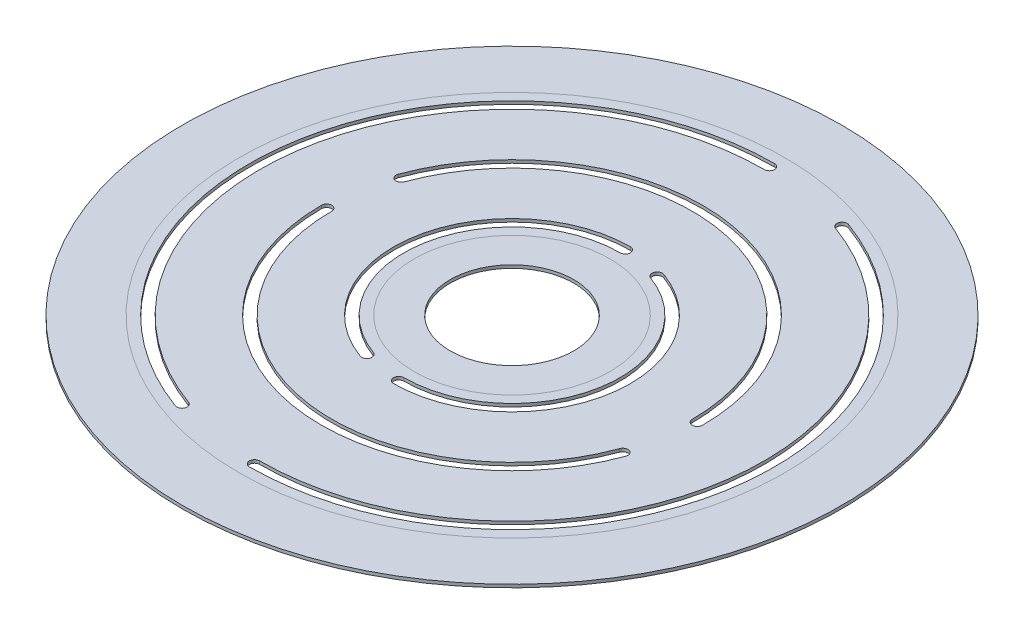
ISO-10303-21;
HEADER;
FILE_DESCRIPTION(('STEP AP214'),'2;1');
FILE_NAME('part.step','',(''),(''),'','','');
FILE_SCHEMA(('AUTOMOTIVE_DESIGN { 1 0 10303 214 1 1 1 1 }'));
ENDSEC;
DATA;
#1=APPLICATION_CONTEXT('core data for automotive mechanical design processes');
#2=APPLICATION_PROTOCOL_DEFINITION('international standard','automotive_design',2000,#1);
#3=PRODUCT_CONTEXT('',#1,'mechanical');
#4=PRODUCT('Part','Part','',(#3));
#5=PRODUCT_RELATED_PRODUCT_CATEGORY('part','',(#4));
#6=PRODUCT_DEFINITION_FORMATION('','',#4);
#7=PRODUCT_DEFINITION_CONTEXT('part definition',#1,'design');
#8=PRODUCT_DEFINITION('design','',#6,#7);
#9=PRODUCT_DEFINITION_SHAPE('','',#8);
#10=(LENGTH_UNIT() NAMED_UNIT(*) SI_UNIT(.MILLI.,.METRE.));
#11=(NAMED_UNIT(*) PLANE_ANGLE_UNIT() SI_UNIT($,.RADIAN.));
#12=(NAMED_UNIT(*) SI_UNIT($,.STERADIAN.) SOLID_ANGLE_UNIT());
#13=UNCERTAINTY_MEASURE_WITH_UNIT(LENGTH_MEASURE(1.E-05),#10,'distance_accuracy_value','');
#14=(GEOMETRIC_REPRESENTATION_CONTEXT(3) GLOBAL_UNCERTAINTY_ASSIGNED_CONTEXT((#13)) GLOBAL_UNIT_ASSIGNED_CONTEXT((#10,
#11,#12)) REPRESENTATION_CONTEXT('',''));
#15=CARTESIAN_POINT('',(0.,0.,0.));
#16=DIRECTION('',(0.,0.,1.));
#17=DIRECTION('',(1.,0.,0.));
#18=AXIS2_PLACEMENT_3D('',#15,#16,#17);
#19=CARTESIAN_POINT('',(0.,0.3,0.));
#20=DIRECTION('',(0.,1.,0.));
#21=DIRECTION('',(0.,0.,1.));
#22=AXIS2_PLACEMENT_3D('',#19,#20,#21);
#23=PLANE('',#22);
#24=CARTESIAN_POINT('',(0.,0.3,0.));
#25=DIRECTION('',(0.,1.,0.));
#26=DIRECTION('',(0.,0.,1.));
#27=AXIS2_PLACEMENT_3D('',#24,#25,#26);
#28=CIRCLE('',#27,32.);
#29=CARTESIAN_POINT('',(0.,0.3,32.));
#30=VERTEX_POINT('',#29);
#31=EDGE_CURVE('E261',#30,#30,#28,.T.);
#32=ORIENTED_EDGE('',*,*,#31,.T.);
#33=EDGE_LOOP('',(#32));
#34=FACE_BOUND('',#33,.T.);
#35=CARTESIAN_POINT('',(0.,0.3,0.));
#36=DIRECTION('',(0.,1.,0.));
#37=DIRECTION('',(0.,0.,1.));
#38=AXIS2_PLACEMENT_3D('',#35,#36,#37);
#39=CIRCLE('',#38,26.5);
#40=CARTESIAN_POINT('',(0.,0.3,26.5));
#41=VERTEX_POINT('',#40);
#42=EDGE_CURVE('E12',#41,#41,#39,.F.);
#43=ORIENTED_EDGE('',*,*,#42,.T.);
#44=EDGE_LOOP('',(#43));
#45=FACE_BOUND('',#44,.T.);
#46=ADVANCED_FACE('F53',(#34,#45),#23,.T.);
#47=ORIENTED_EDGE('',*,*,#42,.F.);
#48=EDGE_LOOP('',(#47));
#49=FACE_BOUND('',#48,.T.);
#50=CARTESIAN_POINT('',(-8.55050358314157,0.3,23.4923155196478));
#51=DIRECTION('',(0.,1.,0.));
#52=DIRECTION('',(0.,0.,1.));
#53=AXIS2_PLACEMENT_3D('',#50,#51,#52);
#54=CIRCLE('',#53,0.500000000000002);
#55=CARTESIAN_POINT('',(-8.72151365480442,0.3,23.9621618300407));
#56=VERTEX_POINT('',#55);
#57=CARTESIAN_POINT('',(-8.37949351147876,0.3,23.0224692092548));
#58=VERTEX_POINT('',#57);
#59=EDGE_CURVE('E248',#56,#58,#54,.T.);
#60=ORIENTED_EDGE('',*,*,#59,.F.);
#61=CARTESIAN_POINT('',(0.,0.3,0.));
#62=DIRECTION('',(0.,1.,0.));
#63=DIRECTION('',(0.,0.,1.));
#64=AXIS2_PLACEMENT_3D('',#61,#62,#63);
#65=CIRCLE('',#64,25.5);
#66=CARTESIAN_POINT('',(0.,0.3,-25.5));
#67=VERTEX_POINT('',#66);
#68=EDGE_CURVE('E235',#67,#56,#65,.T.);
#69=ORIENTED_EDGE('',*,*,#68,.F.);
#70=CARTESIAN_POINT('',(0.,0.3,-25.));
#71=DIRECTION('',(0.,1.,0.));
#72=DIRECTION('',(0.,0.,1.));
#73=AXIS2_PLACEMENT_3D('',#70,#71,#72);
#74=CIRCLE('',#73,0.5);
#75=CARTESIAN_POINT('',(0.,0.3,-24.5));
#76=VERTEX_POINT('',#75);
#77=EDGE_CURVE('E241',#67,#76,#74,.F.);
#78=ORIENTED_EDGE('',*,*,#77,.T.);
#79=CARTESIAN_POINT('',(0.,0.3,0.));
#80=DIRECTION('',(0.,1.,0.));
#81=DIRECTION('',(0.,0.,1.));
#82=AXIS2_PLACEMENT_3D('',#79,#80,#81);
#83=CIRCLE('',#82,24.5);
#84=EDGE_CURVE('E75',#76,#58,#83,.T.);
#85=ORIENTED_EDGE('',*,*,#84,.T.);
#86=EDGE_LOOP('',(#60,#69,#78,#85));
#87=FACE_BOUND('',#86,.T.);
#88=CARTESIAN_POINT('',(-16.9144671741464,0.3,-6.15636257986193));
#89=DIRECTION('',(0.,1.,0.));
#90=DIRECTION('',(0.,0.,1.));
#91=AXIS2_PLACEMENT_3D('',#88,#89,#90);
#92=CIRCLE('',#91,0.5);
#93=CARTESIAN_POINT('',(-17.3843134845393,0.3,-6.32737265152476));
#94=VERTEX_POINT('',#93);
#95=CARTESIAN_POINT('',(-16.4446208637534,0.3,-5.9853525081991));
#96=VERTEX_POINT('',#95);
#97=EDGE_CURVE('E621',#94,#96,#92,.T.);
#98=ORIENTED_EDGE('',*,*,#97,.F.);
#99=CARTESIAN_POINT('',(0.,0.3,0.));
#100=DIRECTION('',(0.,1.,0.));
#101=DIRECTION('',(0.,0.,1.));
#102=AXIS2_PLACEMENT_3D('',#99,#100,#101);
#103=CIRCLE('',#102,18.5);
#104=CARTESIAN_POINT('',(18.5,0.3,0.));
#105=VERTEX_POINT('',#104);
#106=EDGE_CURVE('E626',#105,#94,#103,.T.);
#107=ORIENTED_EDGE('',*,*,#106,.F.);
#108=CARTESIAN_POINT('',(18.,0.3,0.));
#109=DIRECTION('',(0.,1.,0.));
#110=DIRECTION('',(0.,0.,1.));
#111=AXIS2_PLACEMENT_3D('',#108,#109,#110);
#112=CIRCLE('',#111,0.500000000000002);
#113=CARTESIAN_POINT('',(17.5,0.3,0.));
#114=VERTEX_POINT('',#113);
#115=EDGE_CURVE('E632',#105,#114,#112,.F.);
#116=ORIENTED_EDGE('',*,*,#115,.T.);
#117=CARTESIAN_POINT('',(0.,0.3,0.));
#118=DIRECTION('',(0.,1.,0.));
#119=DIRECTION('',(0.,0.,1.));
#120=AXIS2_PLACEMENT_3D('',#117,#118,#119);
#121=CIRCLE('',#120,17.5);
#122=EDGE_CURVE('E252',#114,#96,#121,.T.);
#123=ORIENTED_EDGE('',*,*,#122,.T.);
#124=EDGE_LOOP('',(#98,#107,#116,#123));
#125=FACE_BOUND('',#124,.T.);
#126=CARTESIAN_POINT('',(8.55050358314157,0.3,-23.4923155196478));
#127=DIRECTION('',(0.,1.,0.));
#128=DIRECTION('',(0.,0.,1.));
#129=AXIS2_PLACEMENT_3D('',#126,#127,#128);
#130=CIRCLE('',#129,0.500000000000002);
#131=CARTESIAN_POINT('',(8.7215136548044,0.3,-23.9621618300407));
#132=VERTEX_POINT('',#131);
#133=CARTESIAN_POINT('',(8.37949351147874,0.3,-23.0224692092548));
#134=VERTEX_POINT('',#133);
#135=EDGE_CURVE('E609',#132,#134,#130,.T.);
#136=ORIENTED_EDGE('',*,*,#135,.F.);
#137=CARTESIAN_POINT('',(0.,0.3,0.));
#138=DIRECTION('',(0.,1.,0.));
#139=DIRECTION('',(0.,0.,1.));
#140=AXIS2_PLACEMENT_3D('',#137,#138,#139);
#141=CIRCLE('',#140,25.5);
#142=CARTESIAN_POINT('',(0.,0.3,25.5));
#143=VERTEX_POINT('',#142);
#144=EDGE_CURVE('E611',#143,#132,#141,.T.);
#145=ORIENTED_EDGE('',*,*,#144,.F.);
#146=CARTESIAN_POINT('',(0.,0.3,25.));
#147=DIRECTION('',(0.,1.,0.));
#148=DIRECTION('',(0.,0.,1.));
#149=AXIS2_PLACEMENT_3D('',#146,#147,#148);
#150=CIRCLE('',#149,0.5);
#151=CARTESIAN_POINT('',(0.,0.3,24.5));
#152=VERTEX_POINT('',#151);
#153=EDGE_CURVE('E617',#143,#152,#150,.F.);
#154=ORIENTED_EDGE('',*,*,#153,.T.);
#155=CARTESIAN_POINT('',(0.,0.3,0.));
#156=DIRECTION('',(0.,1.,0.));
#157=DIRECTION('',(0.,0.,1.));
#158=AXIS2_PLACEMENT_3D('',#155,#156,#157);
#159=CIRCLE('',#158,24.5);
#160=EDGE_CURVE('E616',#152,#134,#159,.T.);
#161=ORIENTED_EDGE('',*,*,#160,.T.);
#162=EDGE_LOOP('',(#136,#145,#154,#161));
#163=FACE_BOUND('',#162,.T.);
#164=CARTESIAN_POINT('',(-3.76222157658229,0.3,10.336618828645));
#165=DIRECTION('',(0.,1.,0.));
#166=DIRECTION('',(0.,0.,1.));
#167=AXIS2_PLACEMENT_3D('',#164,#165,#166);
#168=CIRCLE('',#167,0.5);
#169=CARTESIAN_POINT('',(-3.93323164824513,0.3,10.806465139038));
#170=VERTEX_POINT('',#169);
#171=CARTESIAN_POINT('',(-3.59121150491947,0.3,9.86677251825206));
#172=VERTEX_POINT('',#171);
#173=EDGE_CURVE('E593',#170,#172,#168,.T.);
#174=ORIENTED_EDGE('',*,*,#173,.F.);
#175=CARTESIAN_POINT('',(0.,0.3,0.));
#176=DIRECTION('',(0.,1.,0.));
#177=DIRECTION('',(0.,0.,1.));
#178=AXIS2_PLACEMENT_3D('',#175,#176,#177);
#179=CIRCLE('',#178,11.5);
#180=CARTESIAN_POINT('',(0.,0.3,-11.5));
#181=VERTEX_POINT('',#180);
#182=EDGE_CURVE('E600',#181,#170,#179,.T.);
#183=ORIENTED_EDGE('',*,*,#182,.F.);
#184=CARTESIAN_POINT('',(0.,0.3,-11.));
#185=DIRECTION('',(0.,1.,0.));
#186=DIRECTION('',(0.,0.,1.));
#187=AXIS2_PLACEMENT_3D('',#184,#185,#186);
#188=CIRCLE('',#187,0.5);
#189=CARTESIAN_POINT('',(0.,0.3,-10.5));
#190=VERTEX_POINT('',#189);
#191=EDGE_CURVE('E601',#181,#190,#188,.F.);
#192=ORIENTED_EDGE('',*,*,#191,.T.);
#193=CARTESIAN_POINT('',(0.,0.3,0.));
#194=DIRECTION('',(0.,1.,0.));
#195=DIRECTION('',(0.,0.,1.));
#196=AXIS2_PLACEMENT_3D('',#193,#194,#195);
#197=CIRCLE('',#196,10.5);
#198=EDGE_CURVE('E604',#190,#172,#197,.T.);
#199=ORIENTED_EDGE('',*,*,#198,.T.);
#200=EDGE_LOOP('',(#174,#183,#192,#199));
#201=FACE_BOUND('',#200,.T.);
#202=CARTESIAN_POINT('',(3.76222157658229,0.3,-10.336618828645));
#203=DIRECTION('',(0.,1.,0.));
#204=DIRECTION('',(0.,0.,1.));
#205=AXIS2_PLACEMENT_3D('',#202,#203,#204);
#206=CIRCLE('',#205,0.5);
#207=CARTESIAN_POINT('',(3.93323164824513,0.3,-10.806465139038));
#208=VERTEX_POINT('',#207);
#209=CARTESIAN_POINT('',(3.59121150491947,0.3,-9.86677251825206));
#210=VERTEX_POINT('',#209);
#211=EDGE_CURVE('E574',#208,#210,#206,.T.);
#212=ORIENTED_EDGE('',*,*,#211,.F.);
#213=CARTESIAN_POINT('',(0.,0.3,0.));
#214=DIRECTION('',(0.,1.,0.));
#215=DIRECTION('',(0.,0.,1.));
#216=AXIS2_PLACEMENT_3D('',#213,#214,#215);
#217=CIRCLE('',#216,11.5);
#218=CARTESIAN_POINT('',(0.,0.3,11.5));
#219=VERTEX_POINT('',#218);
#220=EDGE_CURVE('E580',#219,#208,#217,.T.);
#221=ORIENTED_EDGE('',*,*,#220,.F.);
#222=CARTESIAN_POINT('',(0.,0.3,11.));
#223=DIRECTION('',(0.,1.,0.));
#224=DIRECTION('',(0.,0.,1.));
#225=AXIS2_PLACEMENT_3D('',#222,#223,#224);
#226=CIRCLE('',#225,0.5);
#227=CARTESIAN_POINT('',(0.,0.3,10.5));
#228=VERTEX_POINT('',#227);
#229=EDGE_CURVE('E588',#219,#228,#226,.F.);
#230=ORIENTED_EDGE('',*,*,#229,.T.);
#231=CARTESIAN_POINT('',(0.,0.3,0.));
#232=DIRECTION('',(0.,1.,0.));
#233=DIRECTION('',(0.,0.,1.));
#234=AXIS2_PLACEMENT_3D('',#231,#232,#233);
#235=CIRCLE('',#234,10.5);
#236=EDGE_CURVE('E587',#228,#210,#235,.T.);
#237=ORIENTED_EDGE('',*,*,#236,.T.);
#238=EDGE_LOOP('',(#212,#221,#230,#237));
#239=FACE_BOUND('',#238,.T.);
#240=CARTESIAN_POINT('',(16.9144671741464,0.3,6.15636257986193));
#241=DIRECTION('',(0.,1.,0.));
#242=DIRECTION('',(0.,0.,1.));
#243=AXIS2_PLACEMENT_3D('',#240,#241,#242);
#244=CIRCLE('',#243,0.5);
#245=CARTESIAN_POINT('',(17.3843134845393,0.3,6.32737265152476));
#246=VERTEX_POINT('',#245);
#247=CARTESIAN_POINT('',(16.4446208637534,0.3,5.98535250819909));
#248=VERTEX_POINT('',#247);
#249=EDGE_CURVE('E365',#246,#248,#244,.T.);
#250=ORIENTED_EDGE('',*,*,#249,.F.);
#251=CARTESIAN_POINT('',(0.,0.3,0.));
#252=DIRECTION('',(0.,1.,0.));
#253=DIRECTION('',(0.,0.,1.));
#254=AXIS2_PLACEMENT_3D('',#251,#252,#253);
#255=CIRCLE('',#254,18.5);
#256=CARTESIAN_POINT('',(-18.5,0.3,0.));
#257=VERTEX_POINT('',#256);
#258=EDGE_CURVE('E579',#257,#246,#255,.T.);
#259=ORIENTED_EDGE('',*,*,#258,.F.);
#260=CARTESIAN_POINT('',(-18.,0.3,0.));
#261=DIRECTION('',(0.,1.,0.));
#262=DIRECTION('',(0.,0.,1.));
#263=AXIS2_PLACEMENT_3D('',#260,#261,#262);
#264=CIRCLE('',#263,0.500000000000002);
#265=CARTESIAN_POINT('',(-17.5,0.3,0.));
#266=VERTEX_POINT('',#265);
#267=EDGE_CURVE('E571',#257,#266,#264,.F.);
#268=ORIENTED_EDGE('',*,*,#267,.T.);
#269=CARTESIAN_POINT('',(0.,0.3,0.));
#270=DIRECTION('',(0.,1.,0.));
#271=DIRECTION('',(0.,0.,1.));
#272=AXIS2_PLACEMENT_3D('',#269,#270,#271);
#273=CIRCLE('',#272,17.5);
#274=EDGE_CURVE('E566',#266,#248,#273,.T.);
#275=ORIENTED_EDGE('',*,*,#274,.T.);
#276=EDGE_LOOP('',(#250,#259,#268,#275));
#277=FACE_BOUND('',#276,.T.);
#278=CARTESIAN_POINT('',(0.,0.3,0.));
#279=DIRECTION('',(0.,1.,0.));
#280=DIRECTION('',(0.,0.,1.));
#281=AXIS2_PLACEMENT_3D('',#278,#279,#280);
#282=CIRCLE('',#281,9.5);
#283=CARTESIAN_POINT('',(0.,0.3,9.5));
#284=VERTEX_POINT('',#283);
#285=EDGE_CURVE('E63',#284,#284,#282,.F.);
#286=ORIENTED_EDGE('',*,*,#285,.T.);
#287=EDGE_LOOP('',(#286));
#288=FACE_BOUND('',#287,.T.);
#289=ADVANCED_FACE('F247',(#49,#87,#125,#163,#201,#239,#277,#288),#23,.T.);
#290=CARTESIAN_POINT('',(-8.55050358314157,0.3,23.4923155196478));
#291=DIRECTION('',(0.,-1.,0.));
#292=DIRECTION('',(0.,0.,-1.));
#293=AXIS2_PLACEMENT_3D('',#290,#291,#292);
#294=CYLINDRICAL_SURFACE('',#293,0.500000000000002);
#295=CARTESIAN_POINT('',(-8.55050358314157,0.,23.4923155196478));
#296=DIRECTION('',(0.,1.,0.));
#297=DIRECTION('',(0.,0.,1.));
#298=AXIS2_PLACEMENT_3D('',#295,#296,#297);
#299=CIRCLE('',#298,0.500000000000002);
#300=CARTESIAN_POINT('',(-8.72151365480442,0.,23.9621618300407));
#301=VERTEX_POINT('',#300);
#302=CARTESIAN_POINT('',(-8.37949351147876,0.,23.0224692092548));
#303=VERTEX_POINT('',#302);
#304=EDGE_CURVE('E347',#301,#303,#299,.T.);
#305=ORIENTED_EDGE('',*,*,#304,.F.);
#306=DIRECTION('',(0.,-1.,0.));
#307=VECTOR('',#306,1.);
#308=CARTESIAN_POINT('',(-8.72151365480442,0.3,23.9621618300407));
#309=LINE('',#308,#307);
#310=EDGE_CURVE('E236',#56,#301,#309,.T.);
#311=ORIENTED_EDGE('',*,*,#310,.F.);
#312=ORIENTED_EDGE('',*,*,#59,.T.);
#313=DIRECTION('',(0.,-1.,0.));
#314=VECTOR('',#313,1.);
#315=CARTESIAN_POINT('',(-8.37949351147876,0.3,23.0224692092548));
#316=LINE('',#315,#314);
#317=EDGE_CURVE('E156',#58,#303,#316,.T.);
#318=ORIENTED_EDGE('',*,*,#317,.T.);
#319=EDGE_LOOP('',(#305,#311,#312,#318));
#320=FACE_BOUND('',#319,.T.);
#321=ADVANCED_FACE('F474',(#320),#294,.F.);
#322=CARTESIAN_POINT('',(0.,0.3,0.));
#323=DIRECTION('',(0.,-1.,0.));
#324=DIRECTION('',(0.,0.,-1.));
#325=AXIS2_PLACEMENT_3D('',#322,#323,#324);
#326=CYLINDRICAL_SURFACE('',#325,25.5);
#327=CARTESIAN_POINT('',(0.,0.,0.));
#328=DIRECTION('',(0.,1.,0.));
#329=DIRECTION('',(0.,0.,1.));
#330=AXIS2_PLACEMENT_3D('',#327,#328,#329);
#331=CIRCLE('',#330,25.5);
#332=CARTESIAN_POINT('',(0.,0.,-25.5));
#333=VERTEX_POINT('',#332);
#334=EDGE_CURVE('E234',#333,#301,#331,.T.);
#335=ORIENTED_EDGE('',*,*,#334,.F.);
#336=DIRECTION('',(0.,-1.,0.));
#337=VECTOR('',#336,1.);
#338=CARTESIAN_POINT('',(0.,0.3,-25.5));
#339=LINE('',#338,#337);
#340=EDGE_CURVE('E230',#67,#333,#339,.T.);
#341=ORIENTED_EDGE('',*,*,#340,.F.);
#342=ORIENTED_EDGE('',*,*,#68,.T.);
#343=ORIENTED_EDGE('',*,*,#310,.T.);
#344=EDGE_LOOP('',(#335,#341,#342,#343));
#345=FACE_BOUND('',#344,.T.);
#346=ADVANCED_FACE('F227',(#345),#326,.F.);
#347=CARTESIAN_POINT('',(0.,0.3,-25.));
#348=DIRECTION('',(0.,-1.,0.));
#349=DIRECTION('',(0.,0.,-1.));
#350=AXIS2_PLACEMENT_3D('',#347,#348,#349);
#351=CYLINDRICAL_SURFACE('',#350,0.5);
#352=CARTESIAN_POINT('',(0.,0.,-25.));
#353=DIRECTION('',(0.,1.,0.));
#354=DIRECTION('',(0.,0.,1.));
#355=AXIS2_PLACEMENT_3D('',#352,#353,#354);
#356=CIRCLE('',#355,0.5);
#357=CARTESIAN_POINT('',(0.,0.,-24.5));
#358=VERTEX_POINT('',#357);
#359=EDGE_CURVE('E354',#333,#358,#356,.F.);
#360=ORIENTED_EDGE('',*,*,#359,.T.);
#361=DIRECTION('',(0.,-1.,0.));
#362=VECTOR('',#361,1.);
#363=CARTESIAN_POINT('',(0.,0.3,-24.5));
#364=LINE('',#363,#362);
#365=EDGE_CURVE('E239',#76,#358,#364,.T.);
#366=ORIENTED_EDGE('',*,*,#365,.F.);
#367=ORIENTED_EDGE('',*,*,#77,.F.);
#368=ORIENTED_EDGE('',*,*,#340,.T.);
#369=EDGE_LOOP('',(#360,#366,#367,#368));
#370=FACE_BOUND('',#369,.T.);
#371=ADVANCED_FACE('F245',(#370),#351,.F.);
#372=CARTESIAN_POINT('',(-16.9144671741464,0.3,-6.15636257986193));
#373=DIRECTION('',(0.,-1.,0.));
#374=DIRECTION('',(0.,0.,-1.));
#375=AXIS2_PLACEMENT_3D('',#372,#373,#374);
#376=CYLINDRICAL_SURFACE('',#375,0.5);
#377=CARTESIAN_POINT('',(-16.9144671741464,0.,-6.15636257986193));
#378=DIRECTION('',(0.,1.,0.));
#379=DIRECTION('',(0.,0.,1.));
#380=AXIS2_PLACEMENT_3D('',#377,#378,#379);
#381=CIRCLE('',#380,0.5);
#382=CARTESIAN_POINT('',(-17.3843134845393,0.,-6.32737265152476));
#383=VERTEX_POINT('',#382);
#384=CARTESIAN_POINT('',(-16.4446208637534,0.,-5.9853525081991));
#385=VERTEX_POINT('',#384);
#386=EDGE_CURVE('E329',#383,#385,#381,.T.);
#387=ORIENTED_EDGE('',*,*,#386,.F.);
#388=DIRECTION('',(0.,-1.,0.));
#389=VECTOR('',#388,1.);
#390=CARTESIAN_POINT('',(-17.3843134845393,0.3,-6.32737265152476));
#391=LINE('',#390,#389);
#392=EDGE_CURVE('E370',#94,#383,#391,.T.);
#393=ORIENTED_EDGE('',*,*,#392,.F.);
#394=ORIENTED_EDGE('',*,*,#97,.T.);
#395=DIRECTION('',(0.,-1.,0.));
#396=VECTOR('',#395,1.);
#397=CARTESIAN_POINT('',(-16.4446208637534,0.3,-5.9853525081991));
#398=LINE('',#397,#396);
#399=EDGE_CURVE('E375',#96,#385,#398,.T.);
#400=ORIENTED_EDGE('',*,*,#399,.T.);
#401=EDGE_LOOP('',(#387,#393,#394,#400));
#402=FACE_BOUND('',#401,.T.);
#403=ADVANCED_FACE('F504',(#402),#376,.F.);
#404=CARTESIAN_POINT('',(0.,0.3,0.));
#405=DIRECTION('',(0.,-1.,0.));
#406=DIRECTION('',(0.,0.,-1.));
#407=AXIS2_PLACEMENT_3D('',#404,#405,#406);
#408=CYLINDRICAL_SURFACE('',#407,18.5);
#409=CARTESIAN_POINT('',(0.,0.,0.));
#410=DIRECTION('',(0.,1.,0.));
#411=DIRECTION('',(0.,0.,1.));
#412=AXIS2_PLACEMENT_3D('',#409,#410,#411);
#413=CIRCLE('',#412,18.5);
#414=CARTESIAN_POINT('',(18.5,0.,0.));
#415=VERTEX_POINT('',#414);
#416=EDGE_CURVE('E331',#415,#383,#413,.T.);
#417=ORIENTED_EDGE('',*,*,#416,.F.);
#418=DIRECTION('',(0.,-1.,0.));
#419=VECTOR('',#418,1.);
#420=CARTESIAN_POINT('',(18.5,0.3,0.));
#421=LINE('',#420,#419);
#422=EDGE_CURVE('E379',#105,#415,#421,.T.);
#423=ORIENTED_EDGE('',*,*,#422,.F.);
#424=ORIENTED_EDGE('',*,*,#106,.T.);
#425=ORIENTED_EDGE('',*,*,#392,.T.);
#426=EDGE_LOOP('',(#417,#423,#424,#425));
#427=FACE_BOUND('',#426,.T.);
#428=ADVANCED_FACE('F500',(#427),#408,.F.);
#429=CARTESIAN_POINT('',(18.,0.3,0.));
#430=DIRECTION('',(0.,-1.,0.));
#431=DIRECTION('',(0.,0.,-1.));
#432=AXIS2_PLACEMENT_3D('',#429,#430,#431);
#433=CYLINDRICAL_SURFACE('',#432,0.500000000000002);
#434=CARTESIAN_POINT('',(18.,0.,0.));
#435=DIRECTION('',(0.,1.,0.));
#436=DIRECTION('',(0.,0.,1.));
#437=AXIS2_PLACEMENT_3D('',#434,#435,#436);
#438=CIRCLE('',#437,0.500000000000002);
#439=CARTESIAN_POINT('',(17.5,0.,0.));
#440=VERTEX_POINT('',#439);
#441=EDGE_CURVE('E340',#415,#440,#438,.F.);
#442=ORIENTED_EDGE('',*,*,#441,.T.);
#443=DIRECTION('',(0.,-1.,0.));
#444=VECTOR('',#443,1.);
#445=CARTESIAN_POINT('',(17.5,0.3,0.));
#446=LINE('',#445,#444);
#447=EDGE_CURVE('E374',#114,#440,#446,.T.);
#448=ORIENTED_EDGE('',*,*,#447,.F.);
#449=ORIENTED_EDGE('',*,*,#115,.F.);
#450=ORIENTED_EDGE('',*,*,#422,.T.);
#451=EDGE_LOOP('',(#442,#448,#449,#450));
#452=FACE_BOUND('',#451,.T.);
#453=ADVANCED_FACE('F492',(#452),#433,.F.);
#454=CARTESIAN_POINT('',(8.55050358314157,0.3,-23.4923155196478));
#455=DIRECTION('',(0.,-1.,0.));
#456=DIRECTION('',(0.,0.,-1.));
#457=AXIS2_PLACEMENT_3D('',#454,#455,#456);
#458=CYLINDRICAL_SURFACE('',#457,0.500000000000002);
#459=CARTESIAN_POINT('',(8.55050358314157,0.,-23.4923155196478));
#460=DIRECTION('',(0.,1.,0.));
#461=DIRECTION('',(0.,0.,1.));
#462=AXIS2_PLACEMENT_3D('',#459,#460,#461);
#463=CIRCLE('',#462,0.500000000000002);
#464=CARTESIAN_POINT('',(8.7215136548044,0.,-23.9621618300407));
#465=VERTEX_POINT('',#464);
#466=CARTESIAN_POINT('',(8.37949351147874,0.,-23.0224692092548));
#467=VERTEX_POINT('',#466);
#468=EDGE_CURVE('E314',#465,#467,#463,.T.);
#469=ORIENTED_EDGE('',*,*,#468,.F.);
#470=DIRECTION('',(0.,-1.,0.));
#471=VECTOR('',#470,1.);
#472=CARTESIAN_POINT('',(8.7215136548044,0.3,-23.9621618300407));
#473=LINE('',#472,#471);
#474=EDGE_CURVE('E376',#132,#465,#473,.T.);
#475=ORIENTED_EDGE('',*,*,#474,.F.);
#476=ORIENTED_EDGE('',*,*,#135,.T.);
#477=DIRECTION('',(0.,-1.,0.));
#478=VECTOR('',#477,1.);
#479=CARTESIAN_POINT('',(8.37949351147874,0.3,-23.0224692092548));
#480=LINE('',#479,#478);
#481=EDGE_CURVE('E384',#134,#467,#480,.T.);
#482=ORIENTED_EDGE('',*,*,#481,.T.);
#483=EDGE_LOOP('',(#469,#475,#476,#482));
#484=FACE_BOUND('',#483,.T.);
#485=ADVANCED_FACE('F497',(#484),#458,.F.);
#486=CARTESIAN_POINT('',(0.,0.3,0.));
#487=DIRECTION('',(0.,-1.,0.));
#488=DIRECTION('',(0.,0.,-1.));
#489=AXIS2_PLACEMENT_3D('',#486,#487,#488);
#490=CYLINDRICAL_SURFACE('',#489,25.5);
#491=CARTESIAN_POINT('',(0.,0.,0.));
#492=DIRECTION('',(0.,1.,0.));
#493=DIRECTION('',(0.,0.,1.));
#494=AXIS2_PLACEMENT_3D('',#491,#492,#493);
#495=CIRCLE('',#494,25.5);
#496=CARTESIAN_POINT('',(0.,0.,25.5));
#497=VERTEX_POINT('',#496);
#498=EDGE_CURVE('E318',#497,#465,#495,.T.);
#499=ORIENTED_EDGE('',*,*,#498,.F.);
#500=DIRECTION('',(0.,-1.,0.));
#501=VECTOR('',#500,1.);
#502=CARTESIAN_POINT('',(0.,0.3,25.5));
#503=LINE('',#502,#501);
#504=EDGE_CURVE('E395',#143,#497,#503,.T.);
#505=ORIENTED_EDGE('',*,*,#504,.F.);
#506=ORIENTED_EDGE('',*,*,#144,.T.);
#507=ORIENTED_EDGE('',*,*,#474,.T.);
#508=EDGE_LOOP('',(#499,#505,#506,#507));
#509=FACE_BOUND('',#508,.T.);
#510=ADVANCED_FACE('F514',(#509),#490,.F.);
#511=CARTESIAN_POINT('',(0.,0.3,25.));
#512=DIRECTION('',(0.,-1.,0.));
#513=DIRECTION('',(0.,0.,-1.));
#514=AXIS2_PLACEMENT_3D('',#511,#512,#513);
#515=CYLINDRICAL_SURFACE('',#514,0.5);
#516=CARTESIAN_POINT('',(0.,0.,25.));
#517=DIRECTION('',(0.,1.,0.));
#518=DIRECTION('',(0.,0.,1.));
#519=AXIS2_PLACEMENT_3D('',#516,#517,#518);
#520=CIRCLE('',#519,0.5);
#521=CARTESIAN_POINT('',(0.,0.,24.5));
#522=VERTEX_POINT('',#521);
#523=EDGE_CURVE('E325',#497,#522,#520,.F.);
#524=ORIENTED_EDGE('',*,*,#523,.T.);
#525=DIRECTION('',(0.,-1.,0.));
#526=VECTOR('',#525,1.);
#527=CARTESIAN_POINT('',(0.,0.3,24.5));
#528=LINE('',#527,#526);
#529=EDGE_CURVE('E389',#152,#522,#528,.T.);
#530=ORIENTED_EDGE('',*,*,#529,.F.);
#531=ORIENTED_EDGE('',*,*,#153,.F.);
#532=ORIENTED_EDGE('',*,*,#504,.T.);
#533=EDGE_LOOP('',(#524,#530,#531,#532));
#534=FACE_BOUND('',#533,.T.);
#535=ADVANCED_FACE('F506',(#534),#515,.F.);
#536=CARTESIAN_POINT('',(-3.76222157658229,0.3,10.336618828645));
#537=DIRECTION('',(0.,-1.,0.));
#538=DIRECTION('',(0.,0.,-1.));
#539=AXIS2_PLACEMENT_3D('',#536,#537,#538);
#540=CYLINDRICAL_SURFACE('',#539,0.5);
#541=CARTESIAN_POINT('',(-3.76222157658229,0.,10.336618828645));
#542=DIRECTION('',(0.,1.,0.));
#543=DIRECTION('',(0.,0.,1.));
#544=AXIS2_PLACEMENT_3D('',#541,#542,#543);
#545=CIRCLE('',#544,0.5);
#546=CARTESIAN_POINT('',(-3.93323164824513,0.,10.806465139038));
#547=VERTEX_POINT('',#546);
#548=CARTESIAN_POINT('',(-3.59121150491947,0.,9.86677251825206));
#549=VERTEX_POINT('',#548);
#550=EDGE_CURVE('E300',#547,#549,#545,.T.);
#551=ORIENTED_EDGE('',*,*,#550,.F.);
#552=DIRECTION('',(0.,-1.,0.));
#553=VECTOR('',#552,1.);
#554=CARTESIAN_POINT('',(-3.93323164824513,0.3,10.806465139038));
#555=LINE('',#554,#553);
#556=EDGE_CURVE('E386',#170,#547,#555,.T.);
#557=ORIENTED_EDGE('',*,*,#556,.F.);
#558=ORIENTED_EDGE('',*,*,#173,.T.);
#559=DIRECTION('',(0.,-1.,0.));
#560=VECTOR('',#559,1.);
#561=CARTESIAN_POINT('',(-3.59121150491947,0.3,9.86677251825206));
#562=LINE('',#561,#560);
#563=EDGE_CURVE('E398',#172,#549,#562,.T.);
#564=ORIENTED_EDGE('',*,*,#563,.T.);
#565=EDGE_LOOP('',(#551,#557,#558,#564));
#566=FACE_BOUND('',#565,.T.);
#567=ADVANCED_FACE('F511',(#566),#540,.F.);
#568=CARTESIAN_POINT('',(0.,0.3,0.));
#569=DIRECTION('',(0.,-1.,0.));
#570=DIRECTION('',(0.,0.,-1.));
#571=AXIS2_PLACEMENT_3D('',#568,#569,#570);
#572=CYLINDRICAL_SURFACE('',#571,11.5);
#573=CARTESIAN_POINT('',(0.,0.,0.));
#574=DIRECTION('',(0.,1.,0.));
#575=DIRECTION('',(0.,0.,1.));
#576=AXIS2_PLACEMENT_3D('',#573,#574,#575);
#577=CIRCLE('',#576,11.5);
#578=CARTESIAN_POINT('',(0.,0.,-11.5));
#579=VERTEX_POINT('',#578);
#580=EDGE_CURVE('E305',#579,#547,#577,.T.);
#581=ORIENTED_EDGE('',*,*,#580,.F.);
#582=DIRECTION('',(0.,-1.,0.));
#583=VECTOR('',#582,1.);
#584=CARTESIAN_POINT('',(0.,0.3,-11.5));
#585=LINE('',#584,#583);
#586=EDGE_CURVE('E409',#181,#579,#585,.T.);
#587=ORIENTED_EDGE('',*,*,#586,.F.);
#588=ORIENTED_EDGE('',*,*,#182,.T.);
#589=ORIENTED_EDGE('',*,*,#556,.T.);
#590=EDGE_LOOP('',(#581,#587,#588,#589));
#591=FACE_BOUND('',#590,.T.);
#592=ADVANCED_FACE('F530',(#591),#572,.F.);
#593=CARTESIAN_POINT('',(0.,0.3,-11.));
#594=DIRECTION('',(0.,-1.,0.));
#595=DIRECTION('',(0.,0.,-1.));
#596=AXIS2_PLACEMENT_3D('',#593,#594,#595);
#597=CYLINDRICAL_SURFACE('',#596,0.5);
#598=CARTESIAN_POINT('',(0.,0.,-11.));
#599=DIRECTION('',(0.,1.,0.));
#600=DIRECTION('',(0.,0.,1.));
#601=AXIS2_PLACEMENT_3D('',#598,#599,#600);
#602=CIRCLE('',#601,0.5);
#603=CARTESIAN_POINT('',(0.,0.,-10.5));
#604=VERTEX_POINT('',#603);
#605=EDGE_CURVE('E308',#579,#604,#602,.F.);
#606=ORIENTED_EDGE('',*,*,#605,.T.);
#607=DIRECTION('',(0.,-1.,0.));
#608=VECTOR('',#607,1.);
#609=CARTESIAN_POINT('',(0.,0.3,-10.5));
#610=LINE('',#609,#608);
#611=EDGE_CURVE('E402',#190,#604,#610,.T.);
#612=ORIENTED_EDGE('',*,*,#611,.F.);
#613=ORIENTED_EDGE('',*,*,#191,.F.);
#614=ORIENTED_EDGE('',*,*,#586,.T.);
#615=EDGE_LOOP('',(#606,#612,#613,#614));
#616=FACE_BOUND('',#615,.T.);
#617=ADVANCED_FACE('F521',(#616),#597,.F.);
#618=CARTESIAN_POINT('',(3.76222157658229,0.3,-10.336618828645));
#619=DIRECTION('',(0.,-1.,0.));
#620=DIRECTION('',(0.,0.,-1.));
#621=AXIS2_PLACEMENT_3D('',#618,#619,#620);
#622=CYLINDRICAL_SURFACE('',#621,0.5);
#623=CARTESIAN_POINT('',(3.76222157658229,0.,-10.336618828645));
#624=DIRECTION('',(0.,1.,0.));
#625=DIRECTION('',(0.,0.,1.));
#626=AXIS2_PLACEMENT_3D('',#623,#624,#625);
#627=CIRCLE('',#626,0.5);
#628=CARTESIAN_POINT('',(3.93323164824513,0.,-10.806465139038));
#629=VERTEX_POINT('',#628);
#630=CARTESIAN_POINT('',(3.59121150491947,0.,-9.86677251825206));
#631=VERTEX_POINT('',#630);
#632=EDGE_CURVE('E281',#629,#631,#627,.T.);
#633=ORIENTED_EDGE('',*,*,#632,.F.);
#634=DIRECTION('',(0.,-1.,0.));
#635=VECTOR('',#634,1.);
#636=CARTESIAN_POINT('',(3.93323164824513,0.3,-10.806465139038));
#637=LINE('',#636,#635);
#638=EDGE_CURVE('E405',#208,#629,#637,.T.);
#639=ORIENTED_EDGE('',*,*,#638,.F.);
#640=ORIENTED_EDGE('',*,*,#211,.T.);
#641=DIRECTION('',(0.,-1.,0.));
#642=VECTOR('',#641,1.);
#643=CARTESIAN_POINT('',(3.59121150491947,0.3,-9.86677251825206));
#644=LINE('',#643,#642);
#645=EDGE_CURVE('E412',#210,#631,#644,.T.);
#646=ORIENTED_EDGE('',*,*,#645,.T.);
#647=EDGE_LOOP('',(#633,#639,#640,#646));
#648=FACE_BOUND('',#647,.T.);
#649=ADVANCED_FACE('F526',(#648),#622,.F.);
#650=CARTESIAN_POINT('',(0.,0.3,0.));
#651=DIRECTION('',(0.,-1.,0.));
#652=DIRECTION('',(0.,0.,-1.));
#653=AXIS2_PLACEMENT_3D('',#650,#651,#652);
#654=CYLINDRICAL_SURFACE('',#653,11.5);
#655=CARTESIAN_POINT('',(0.,0.,0.));
#656=DIRECTION('',(0.,1.,0.));
#657=DIRECTION('',(0.,0.,1.));
#658=AXIS2_PLACEMENT_3D('',#655,#656,#657);
#659=CIRCLE('',#658,11.5);
#660=CARTESIAN_POINT('',(0.,0.,11.5));
#661=VERTEX_POINT('',#660);
#662=EDGE_CURVE('E287',#661,#629,#659,.T.);
#663=ORIENTED_EDGE('',*,*,#662,.F.);
#664=DIRECTION('',(0.,-1.,0.));
#665=VECTOR('',#664,1.);
#666=CARTESIAN_POINT('',(0.,0.3,11.5));
#667=LINE('',#666,#665);
#668=EDGE_CURVE('E416',#219,#661,#667,.T.);
#669=ORIENTED_EDGE('',*,*,#668,.F.);
#670=ORIENTED_EDGE('',*,*,#220,.T.);
#671=ORIENTED_EDGE('',*,*,#638,.T.);
#672=EDGE_LOOP('',(#663,#669,#670,#671));
#673=FACE_BOUND('',#672,.T.);
#674=ADVANCED_FACE('F543',(#673),#654,.F.);
#675=CARTESIAN_POINT('',(0.,0.3,11.));
#676=DIRECTION('',(0.,-1.,0.));
#677=DIRECTION('',(0.,0.,-1.));
#678=AXIS2_PLACEMENT_3D('',#675,#676,#677);
#679=CYLINDRICAL_SURFACE('',#678,0.5);
#680=CARTESIAN_POINT('',(0.,0.,11.));
#681=DIRECTION('',(0.,1.,0.));
#682=DIRECTION('',(0.,0.,1.));
#683=AXIS2_PLACEMENT_3D('',#680,#681,#682);
#684=CIRCLE('',#683,0.5);
#685=CARTESIAN_POINT('',(0.,0.,10.5));
#686=VERTEX_POINT('',#685);
#687=EDGE_CURVE('E286',#661,#686,#684,.F.);
#688=ORIENTED_EDGE('',*,*,#687,.T.);
#689=DIRECTION('',(0.,-1.,0.));
#690=VECTOR('',#689,1.);
#691=CARTESIAN_POINT('',(0.,0.3,10.5));
#692=LINE('',#691,#690);
#693=EDGE_CURVE('E414',#228,#686,#692,.T.);
#694=ORIENTED_EDGE('',*,*,#693,.F.);
#695=ORIENTED_EDGE('',*,*,#229,.F.);
#696=ORIENTED_EDGE('',*,*,#668,.T.);
#697=EDGE_LOOP('',(#688,#694,#695,#696));
#698=FACE_BOUND('',#697,.T.);
#699=ADVANCED_FACE('F539',(#698),#679,.F.);
#700=CARTESIAN_POINT('',(16.9144671741464,0.3,6.15636257986193));
#701=DIRECTION('',(0.,-1.,0.));
#702=DIRECTION('',(0.,0.,-1.));
#703=AXIS2_PLACEMENT_3D('',#700,#701,#702);
#704=CYLINDRICAL_SURFACE('',#703,0.5);
#705=CARTESIAN_POINT('',(16.9144671741464,0.,6.15636257986193));
#706=DIRECTION('',(0.,1.,0.));
#707=DIRECTION('',(0.,0.,1.));
#708=AXIS2_PLACEMENT_3D('',#705,#706,#707);
#709=CIRCLE('',#708,0.5);
#710=CARTESIAN_POINT('',(17.3843134845393,0.,6.32737265152476));
#711=VERTEX_POINT('',#710);
#712=CARTESIAN_POINT('',(16.4446208637534,0.,5.98535250819909));
#713=VERTEX_POINT('',#712);
#714=EDGE_CURVE('E270',#711,#713,#709,.T.);
#715=ORIENTED_EDGE('',*,*,#714,.F.);
#716=DIRECTION('',(0.,-1.,0.));
#717=VECTOR('',#716,1.);
#718=CARTESIAN_POINT('',(17.3843134845393,0.3,6.32737265152476));
#719=LINE('',#718,#717);
#720=EDGE_CURVE('E162',#246,#711,#719,.T.);
#721=ORIENTED_EDGE('',*,*,#720,.F.);
#722=ORIENTED_EDGE('',*,*,#249,.T.);
#723=DIRECTION('',(0.,-1.,0.));
#724=VECTOR('',#723,1.);
#725=CARTESIAN_POINT('',(16.4446208637534,0.3,5.98535250819909));
#726=LINE('',#725,#724);
#727=EDGE_CURVE('E266',#248,#713,#726,.T.);
#728=ORIENTED_EDGE('',*,*,#727,.T.);
#729=EDGE_LOOP('',(#715,#721,#722,#728));
#730=FACE_BOUND('',#729,.T.);
#731=ADVANCED_FACE('F57',(#730),#704,.F.);
#732=CARTESIAN_POINT('',(0.,0.3,0.));
#733=DIRECTION('',(0.,-1.,0.));
#734=DIRECTION('',(0.,0.,-1.));
#735=AXIS2_PLACEMENT_3D('',#732,#733,#734);
#736=CYLINDRICAL_SURFACE('',#735,18.5);
#737=CARTESIAN_POINT('',(0.,0.,0.));
#738=DIRECTION('',(0.,1.,0.));
#739=DIRECTION('',(0.,0.,1.));
#740=AXIS2_PLACEMENT_3D('',#737,#738,#739);
#741=CIRCLE('',#740,18.5);
#742=CARTESIAN_POINT('',(-18.5,0.,0.));
#743=VERTEX_POINT('',#742);
#744=EDGE_CURVE('E271',#743,#711,#741,.T.);
#745=ORIENTED_EDGE('',*,*,#744,.F.);
#746=DIRECTION('',(0.,-1.,0.));
#747=VECTOR('',#746,1.);
#748=CARTESIAN_POINT('',(-18.5,0.3,0.));
#749=LINE('',#748,#747);
#750=EDGE_CURVE('E427',#257,#743,#749,.T.);
#751=ORIENTED_EDGE('',*,*,#750,.F.);
#752=ORIENTED_EDGE('',*,*,#258,.T.);
#753=ORIENTED_EDGE('',*,*,#720,.T.);
#754=EDGE_LOOP('',(#745,#751,#752,#753));
#755=FACE_BOUND('',#754,.T.);
#756=ADVANCED_FACE('F555',(#755),#736,.F.);
#757=CARTESIAN_POINT('',(-18.,0.3,0.));
#758=DIRECTION('',(0.,-1.,0.));
#759=DIRECTION('',(0.,0.,-1.));
#760=AXIS2_PLACEMENT_3D('',#757,#758,#759);
#761=CYLINDRICAL_SURFACE('',#760,0.500000000000002);
#762=CARTESIAN_POINT('',(-18.,0.,0.));
#763=DIRECTION('',(0.,1.,0.));
#764=DIRECTION('',(0.,0.,1.));
#765=AXIS2_PLACEMENT_3D('',#762,#763,#764);
#766=CIRCLE('',#765,0.500000000000002);
#767=CARTESIAN_POINT('',(-17.5,0.,0.));
#768=VERTEX_POINT('',#767);
#769=EDGE_CURVE('E274',#743,#768,#766,.F.);
#770=ORIENTED_EDGE('',*,*,#769,.T.);
#771=DIRECTION('',(0.,-1.,0.));
#772=VECTOR('',#771,1.);
#773=CARTESIAN_POINT('',(-17.5,0.3,0.));
#774=LINE('',#773,#772);
#775=EDGE_CURVE('E422',#266,#768,#774,.T.);
#776=ORIENTED_EDGE('',*,*,#775,.F.);
#777=ORIENTED_EDGE('',*,*,#267,.F.);
#778=ORIENTED_EDGE('',*,*,#750,.T.);
#779=EDGE_LOOP('',(#770,#776,#777,#778));
#780=FACE_BOUND('',#779,.T.);
#781=ADVANCED_FACE('F452',(#780),#761,.F.);
#782=CARTESIAN_POINT('',(0.,0.3,0.));
#783=DIRECTION('',(0.,-1.,0.));
#784=DIRECTION('',(0.,0.,-1.));
#785=AXIS2_PLACEMENT_3D('',#782,#783,#784);
#786=CYLINDRICAL_SURFACE('',#785,6.);
#787=CARTESIAN_POINT('',(0.,0.3,0.));
#788=DIRECTION('',(0.,1.,0.));
#789=DIRECTION('',(0.,0.,1.));
#790=AXIS2_PLACEMENT_3D('',#787,#788,#789);
#791=CIRCLE('',#790,6.);
#792=CARTESIAN_POINT('',(0.,0.3,6.));
#793=VERTEX_POINT('',#792);
#794=EDGE_CURVE('E256',#793,#793,#791,.T.);
#795=ORIENTED_EDGE('',*,*,#794,.T.);
#796=EDGE_LOOP('',(#795));
#797=FACE_BOUND('',#796,.T.);
#798=CARTESIAN_POINT('',(0.,0.,0.));
#799=DIRECTION('',(0.,1.,0.));
#800=DIRECTION('',(0.,0.,1.));
#801=AXIS2_PLACEMENT_3D('',#798,#799,#800);
#802=CIRCLE('',#801,6.);
#803=CARTESIAN_POINT('',(0.,0.,6.));
#804=VERTEX_POINT('',#803);
#805=EDGE_CURVE('E357',#804,#804,#802,.T.);
#806=ORIENTED_EDGE('',*,*,#805,.F.);
#807=EDGE_LOOP('',(#806));
#808=FACE_BOUND('',#807,.T.);
#809=ADVANCED_FACE('F446',(#797,#808),#786,.F.);
#810=CARTESIAN_POINT('',(0.,0.3,0.));
#811=DIRECTION('',(0.,-1.,0.));
#812=DIRECTION('',(0.,0.,-1.));
#813=AXIS2_PLACEMENT_3D('',#810,#811,#812);
#814=CYLINDRICAL_SURFACE('',#813,24.5);
#815=CARTESIAN_POINT('',(0.,0.,0.));
#816=DIRECTION('',(0.,1.,0.));
#817=DIRECTION('',(0.,0.,1.));
#818=AXIS2_PLACEMENT_3D('',#815,#816,#817);
#819=CIRCLE('',#818,24.5);
#820=EDGE_CURVE('E149',#358,#303,#819,.T.);
#821=ORIENTED_EDGE('',*,*,#820,.T.);
#822=ORIENTED_EDGE('',*,*,#317,.F.);
#823=ORIENTED_EDGE('',*,*,#84,.F.);
#824=ORIENTED_EDGE('',*,*,#365,.T.);
#825=EDGE_LOOP('',(#821,#822,#823,#824));
#826=FACE_BOUND('',#825,.T.);
#827=ADVANCED_FACE('F447',(#826),#814,.T.);
#828=CARTESIAN_POINT('',(0.,0.3,0.));
#829=DIRECTION('',(0.,-1.,0.));
#830=DIRECTION('',(0.,0.,-1.));
#831=AXIS2_PLACEMENT_3D('',#828,#829,#830);
#832=CYLINDRICAL_SURFACE('',#831,17.5);
#833=CARTESIAN_POINT('',(0.,0.,0.));
#834=DIRECTION('',(0.,1.,0.));
#835=DIRECTION('',(0.,0.,1.));
#836=AXIS2_PLACEMENT_3D('',#833,#834,#835);
#837=CIRCLE('',#836,17.5);
#838=EDGE_CURVE('E345',#440,#385,#837,.T.);
#839=ORIENTED_EDGE('',*,*,#838,.T.);
#840=ORIENTED_EDGE('',*,*,#399,.F.);
#841=ORIENTED_EDGE('',*,*,#122,.F.);
#842=ORIENTED_EDGE('',*,*,#447,.T.);
#843=EDGE_LOOP('',(#839,#840,#841,#842));
#844=FACE_BOUND('',#843,.T.);
#845=ADVANCED_FACE('F488',(#844),#832,.T.);
#846=CARTESIAN_POINT('',(0.,0.3,0.));
#847=DIRECTION('',(0.,-1.,0.));
#848=DIRECTION('',(0.,0.,-1.));
#849=AXIS2_PLACEMENT_3D('',#846,#847,#848);
#850=CYLINDRICAL_SURFACE('',#849,24.5);
#851=CARTESIAN_POINT('',(0.,0.,0.));
#852=DIRECTION('',(0.,1.,0.));
#853=DIRECTION('',(0.,0.,1.));
#854=AXIS2_PLACEMENT_3D('',#851,#852,#853);
#855=CIRCLE('',#854,24.5);
#856=EDGE_CURVE('E326',#522,#467,#855,.T.);
#857=ORIENTED_EDGE('',*,*,#856,.T.);
#858=ORIENTED_EDGE('',*,*,#481,.F.);
#859=ORIENTED_EDGE('',*,*,#160,.F.);
#860=ORIENTED_EDGE('',*,*,#529,.T.);
#861=EDGE_LOOP('',(#857,#858,#859,#860));
#862=FACE_BOUND('',#861,.T.);
#863=ADVANCED_FACE('F491',(#862),#850,.T.);
#864=CARTESIAN_POINT('',(0.,0.3,0.));
#865=DIRECTION('',(0.,-1.,0.));
#866=DIRECTION('',(0.,0.,-1.));
#867=AXIS2_PLACEMENT_3D('',#864,#865,#866);
#868=CYLINDRICAL_SURFACE('',#867,10.5);
#869=CARTESIAN_POINT('',(0.,0.,0.));
#870=DIRECTION('',(0.,1.,0.));
#871=DIRECTION('',(0.,0.,1.));
#872=AXIS2_PLACEMENT_3D('',#869,#870,#871);
#873=CIRCLE('',#872,10.5);
#874=EDGE_CURVE('E309',#604,#549,#873,.T.);
#875=ORIENTED_EDGE('',*,*,#874,.T.);
#876=ORIENTED_EDGE('',*,*,#563,.F.);
#877=ORIENTED_EDGE('',*,*,#198,.F.);
#878=ORIENTED_EDGE('',*,*,#611,.T.);
#879=EDGE_LOOP('',(#875,#876,#877,#878));
#880=FACE_BOUND('',#879,.T.);
#881=ADVANCED_FACE('F508',(#880),#868,.T.);
#882=CARTESIAN_POINT('',(0.,0.3,0.));
#883=DIRECTION('',(0.,-1.,0.));
#884=DIRECTION('',(0.,0.,-1.));
#885=AXIS2_PLACEMENT_3D('',#882,#883,#884);
#886=CYLINDRICAL_SURFACE('',#885,10.5);
#887=CARTESIAN_POINT('',(0.,0.,0.));
#888=DIRECTION('',(0.,1.,0.));
#889=DIRECTION('',(0.,0.,1.));
#890=AXIS2_PLACEMENT_3D('',#887,#888,#889);
#891=CIRCLE('',#890,10.5);
#892=EDGE_CURVE('E294',#686,#631,#891,.T.);
#893=ORIENTED_EDGE('',*,*,#892,.T.);
#894=ORIENTED_EDGE('',*,*,#645,.F.);
#895=ORIENTED_EDGE('',*,*,#236,.F.);
#896=ORIENTED_EDGE('',*,*,#693,.T.);
#897=EDGE_LOOP('',(#893,#894,#895,#896));
#898=FACE_BOUND('',#897,.T.);
#899=ADVANCED_FACE('F468',(#898),#886,.T.);
#900=CARTESIAN_POINT('',(0.,0.3,0.));
#901=DIRECTION('',(0.,-1.,0.));
#902=DIRECTION('',(0.,0.,-1.));
#903=AXIS2_PLACEMENT_3D('',#900,#901,#902);
#904=CYLINDRICAL_SURFACE('',#903,17.5);
#905=CARTESIAN_POINT('',(0.,0.,0.));
#906=DIRECTION('',(0.,1.,0.));
#907=DIRECTION('',(0.,0.,1.));
#908=AXIS2_PLACEMENT_3D('',#905,#906,#907);
#909=CIRCLE('',#908,17.5);
#910=EDGE_CURVE('E279',#768,#713,#909,.T.);
#911=ORIENTED_EDGE('',*,*,#910,.T.);
#912=ORIENTED_EDGE('',*,*,#727,.F.);
#913=ORIENTED_EDGE('',*,*,#274,.F.);
#914=ORIENTED_EDGE('',*,*,#775,.T.);
#915=EDGE_LOOP('',(#911,#912,#913,#914));
#916=FACE_BOUND('',#915,.T.);
#917=ADVANCED_FACE('F461',(#916),#904,.T.);
#918=CARTESIAN_POINT('',(0.,0.3,0.));
#919=DIRECTION('',(0.,-1.,0.));
#920=DIRECTION('',(0.,0.,-1.));
#921=AXIS2_PLACEMENT_3D('',#918,#919,#920);
#922=CYLINDRICAL_SURFACE('',#921,32.);
#923=ORIENTED_EDGE('',*,*,#31,.F.);
#924=EDGE_LOOP('',(#923));
#925=FACE_BOUND('',#924,.T.);
#926=CARTESIAN_POINT('',(0.,0.,0.));
#927=DIRECTION('',(0.,1.,0.));
#928=DIRECTION('',(0.,0.,1.));
#929=AXIS2_PLACEMENT_3D('',#926,#927,#928);
#930=CIRCLE('',#929,32.);
#931=CARTESIAN_POINT('',(0.,0.,32.));
#932=VERTEX_POINT('',#931);
#933=EDGE_CURVE('E356',#932,#932,#930,.T.);
#934=ORIENTED_EDGE('',*,*,#933,.T.);
#935=EDGE_LOOP('',(#934));
#936=FACE_BOUND('',#935,.T.);
#937=ADVANCED_FACE('F444',(#925,#936),#922,.T.);
#938=ORIENTED_EDGE('',*,*,#285,.F.);
#939=EDGE_LOOP('',(#938));
#940=FACE_BOUND('',#939,.T.);
#941=ORIENTED_EDGE('',*,*,#794,.F.);
#942=EDGE_LOOP('',(#941));
#943=FACE_BOUND('',#942,.T.);
#944=ADVANCED_FACE('F438',(#940,#943),#23,.T.);
#945=CARTESIAN_POINT('',(0.,0.,0.));
#946=DIRECTION('',(0.,1.,0.));
#947=DIRECTION('',(0.,0.,1.));
#948=AXIS2_PLACEMENT_3D('',#945,#946,#947);
#949=PLANE('',#948);
#950=ORIENTED_EDGE('',*,*,#714,.T.);
#951=ORIENTED_EDGE('',*,*,#910,.F.);
#952=ORIENTED_EDGE('',*,*,#769,.F.);
#953=ORIENTED_EDGE('',*,*,#744,.T.);
#954=EDGE_LOOP('',(#950,#951,#952,#953));
#955=FACE_BOUND('',#954,.T.);
#956=ORIENTED_EDGE('',*,*,#632,.T.);
#957=ORIENTED_EDGE('',*,*,#892,.F.);
#958=ORIENTED_EDGE('',*,*,#687,.F.);
#959=ORIENTED_EDGE('',*,*,#662,.T.);
#960=EDGE_LOOP('',(#956,#957,#958,#959));
#961=FACE_BOUND('',#960,.T.);
#962=ORIENTED_EDGE('',*,*,#550,.T.);
#963=ORIENTED_EDGE('',*,*,#874,.F.);
#964=ORIENTED_EDGE('',*,*,#605,.F.);
#965=ORIENTED_EDGE('',*,*,#580,.T.);
#966=EDGE_LOOP('',(#962,#963,#964,#965));
#967=FACE_BOUND('',#966,.T.);
#968=ORIENTED_EDGE('',*,*,#468,.T.);
#969=ORIENTED_EDGE('',*,*,#856,.F.);
#970=ORIENTED_EDGE('',*,*,#523,.F.);
#971=ORIENTED_EDGE('',*,*,#498,.T.);
#972=EDGE_LOOP('',(#968,#969,#970,#971));
#973=FACE_BOUND('',#972,.T.);
#974=ORIENTED_EDGE('',*,*,#386,.T.);
#975=ORIENTED_EDGE('',*,*,#838,.F.);
#976=ORIENTED_EDGE('',*,*,#441,.F.);
#977=ORIENTED_EDGE('',*,*,#416,.T.);
#978=EDGE_LOOP('',(#974,#975,#976,#977));
#979=FACE_BOUND('',#978,.T.);
#980=ORIENTED_EDGE('',*,*,#304,.T.);
#981=ORIENTED_EDGE('',*,*,#820,.F.);
#982=ORIENTED_EDGE('',*,*,#359,.F.);
#983=ORIENTED_EDGE('',*,*,#334,.T.);
#984=EDGE_LOOP('',(#980,#981,#982,#983));
#985=FACE_BOUND('',#984,.T.);
#986=ORIENTED_EDGE('',*,*,#805,.T.);
#987=EDGE_LOOP('',(#986));
#988=FACE_BOUND('',#987,.T.);
#989=ORIENTED_EDGE('',*,*,#933,.F.);
#990=EDGE_LOOP('',(#989));
#991=FACE_BOUND('',#990,.T.);
#992=ADVANCED_FACE('F445',(#955,#961,#967,#973,#979,#985,#988,#991),#949,.F.);
#993=CLOSED_SHELL('',(#46,#289,#321,#346,#371,#403,#428,#453,#485,#510,#535,#567,#592,#617,#649,
#674,#699,#731,#756,#781,#809,#827,#845,#863,#881,#899,#917,#937,#944,#992));
#994=MANIFOLD_SOLID_BREP('B2',#993);
#995=ADVANCED_BREP_SHAPE_REPRESENTATION('',(#18,#994),#14);
#996=SHAPE_DEFINITION_REPRESENTATION(#9,#995);
ENDSEC;
END-ISO-10303-21;
